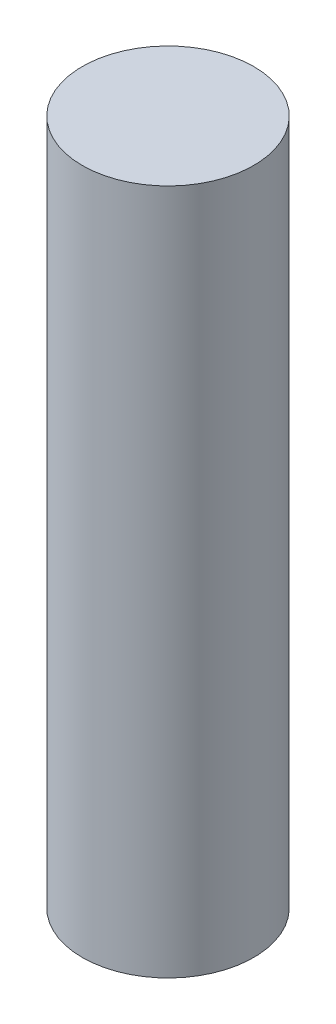
ISO-10303-21;
HEADER;
FILE_DESCRIPTION(('STEP AP214'),'2;1');
FILE_NAME('part.step','',(''),(''),'','','');
FILE_SCHEMA(('AUTOMOTIVE_DESIGN { 1 0 10303 214 1 1 1 1 }'));
ENDSEC;
DATA;
#1=APPLICATION_CONTEXT('core data for automotive mechanical design processes');
#2=APPLICATION_PROTOCOL_DEFINITION('international standard','automotive_design',2000,#1);
#3=PRODUCT_CONTEXT('',#1,'mechanical');
#4=PRODUCT('Part','Part','',(#3));
#5=PRODUCT_RELATED_PRODUCT_CATEGORY('part','',(#4));
#6=PRODUCT_DEFINITION_FORMATION('','',#4);
#7=PRODUCT_DEFINITION_CONTEXT('part definition',#1,'design');
#8=PRODUCT_DEFINITION('design','',#6,#7);
#9=PRODUCT_DEFINITION_SHAPE('','',#8);
#10=(LENGTH_UNIT() NAMED_UNIT(*) SI_UNIT(.MILLI.,.METRE.));
#11=(NAMED_UNIT(*) PLANE_ANGLE_UNIT() SI_UNIT($,.RADIAN.));
#12=(NAMED_UNIT(*) SI_UNIT($,.STERADIAN.) SOLID_ANGLE_UNIT());
#13=UNCERTAINTY_MEASURE_WITH_UNIT(LENGTH_MEASURE(1.E-05),#10,'distance_accuracy_value','');
#14=(GEOMETRIC_REPRESENTATION_CONTEXT(3) GLOBAL_UNCERTAINTY_ASSIGNED_CONTEXT((#13)) GLOBAL_UNIT_ASSIGNED_CONTEXT((#10,
#11,#12)) REPRESENTATION_CONTEXT('',''));
#15=CARTESIAN_POINT('',(0.,0.,0.));
#16=DIRECTION('',(0.,0.,1.));
#17=DIRECTION('',(1.,0.,0.));
#18=AXIS2_PLACEMENT_3D('',#15,#16,#17);
#19=CARTESIAN_POINT('',(0.,6.35,0.));
#20=DIRECTION('',(0.,-1.,0.));
#21=DIRECTION('',(0.,0.,-1.));
#22=AXIS2_PLACEMENT_3D('',#19,#20,#21);
#23=CYLINDRICAL_SURFACE('',#22,0.793749999999999);
#24=CARTESIAN_POINT('',(0.,6.35,0.));
#25=DIRECTION('',(0.,1.,0.));
#26=DIRECTION('',(0.,0.,1.));
#27=AXIS2_PLACEMENT_3D('',#24,#25,#26);
#28=CIRCLE('',#27,0.793749999999999);
#29=CARTESIAN_POINT('',(0.,6.35,0.793749999999999));
#30=VERTEX_POINT('',#29);
#31=EDGE_CURVE('E10',#30,#30,#28,.T.);
#32=ORIENTED_EDGE('',*,*,#31,.F.);
#33=EDGE_LOOP('',(#32));
#34=FACE_BOUND('',#33,.T.);
#35=CARTESIAN_POINT('',(0.,0.,0.));
#36=DIRECTION('',(0.,1.,0.));
#37=DIRECTION('',(0.,0.,1.));
#38=AXIS2_PLACEMENT_3D('',#35,#36,#37);
#39=CIRCLE('',#38,0.793749999999999);
#40=CARTESIAN_POINT('',(0.,0.,0.793749999999999));
#41=VERTEX_POINT('',#40);
#42=EDGE_CURVE('E32',#41,#41,#39,.T.);
#43=ORIENTED_EDGE('',*,*,#42,.T.);
#44=EDGE_LOOP('',(#43));
#45=FACE_BOUND('',#44,.T.);
#46=ADVANCED_FACE('F29',(#34,#45),#23,.T.);
#47=CARTESIAN_POINT('',(0.,6.35,0.));
#48=DIRECTION('',(0.,1.,0.));
#49=DIRECTION('',(0.,0.,1.));
#50=AXIS2_PLACEMENT_3D('',#47,#48,#49);
#51=PLANE('',#50);
#52=ORIENTED_EDGE('',*,*,#31,.T.);
#53=EDGE_LOOP('',(#52));
#54=FACE_BOUND('',#53,.T.);
#55=ADVANCED_FACE('F44',(#54),#51,.T.);
#56=CARTESIAN_POINT('',(0.,0.,0.));
#57=DIRECTION('',(0.,1.,0.));
#58=DIRECTION('',(0.,0.,1.));
#59=AXIS2_PLACEMENT_3D('',#56,#57,#58);
#60=PLANE('',#59);
#61=ORIENTED_EDGE('',*,*,#42,.F.);
#62=EDGE_LOOP('',(#61));
#63=FACE_BOUND('',#62,.T.);
#64=ADVANCED_FACE('F42',(#63),#60,.F.);
#65=CLOSED_SHELL('',(#46,#55,#64));
#66=MANIFOLD_SOLID_BREP('B2',#65);
#67=ADVANCED_BREP_SHAPE_REPRESENTATION('',(#18,#66),#14);
#68=SHAPE_DEFINITION_REPRESENTATION(#9,#67);
ENDSEC;
END-ISO-10303-21;
